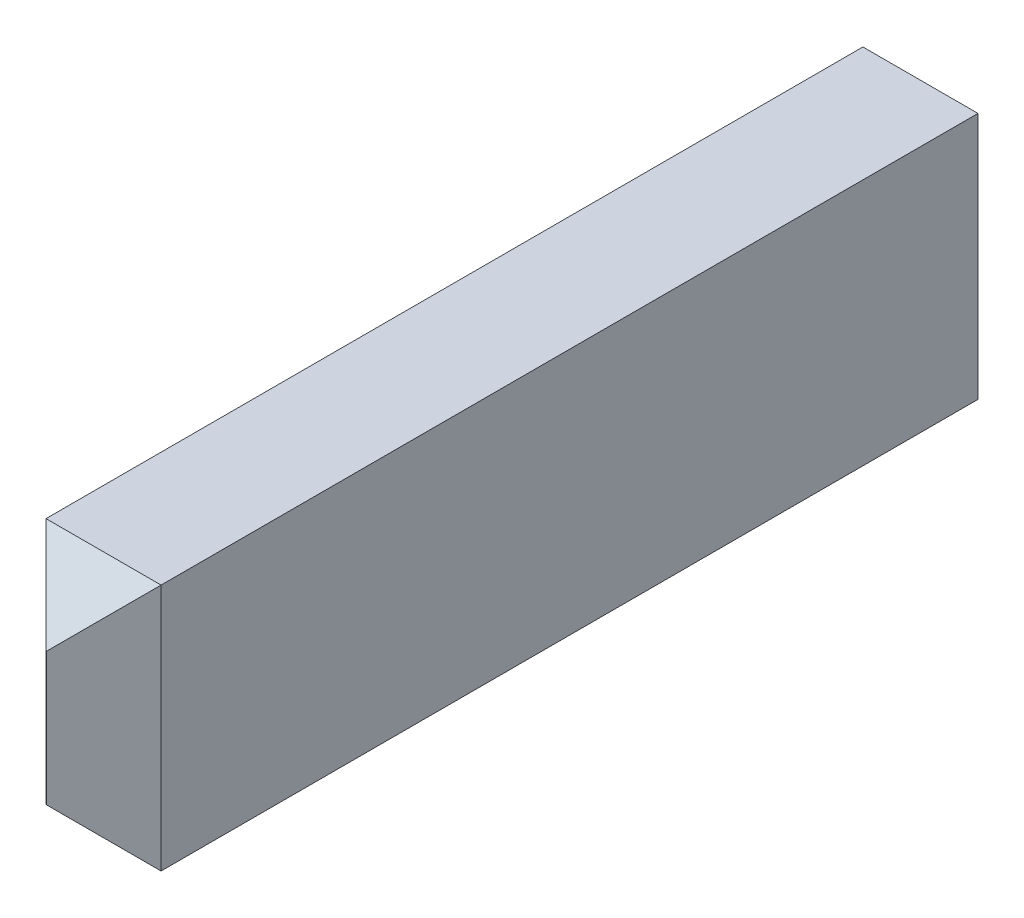
ISO-10303-21;
HEADER;
FILE_DESCRIPTION(('STEP AP214'),'2;1');
FILE_NAME('part.step','',(''),(''),'','','');
FILE_SCHEMA(('AUTOMOTIVE_DESIGN { 1 0 10303 214 1 1 1 1 }'));
ENDSEC;
DATA;
#1=APPLICATION_CONTEXT('core data for automotive mechanical design processes');
#2=APPLICATION_PROTOCOL_DEFINITION('international standard','automotive_design',2000,#1);
#3=PRODUCT_CONTEXT('',#1,'mechanical');
#4=PRODUCT('Part','Part','',(#3));
#5=PRODUCT_RELATED_PRODUCT_CATEGORY('part','',(#4));
#6=PRODUCT_DEFINITION_FORMATION('','',#4);
#7=PRODUCT_DEFINITION_CONTEXT('part definition',#1,'design');
#8=PRODUCT_DEFINITION('design','',#6,#7);
#9=PRODUCT_DEFINITION_SHAPE('','',#8);
#10=(LENGTH_UNIT() NAMED_UNIT(*) SI_UNIT(.MILLI.,.METRE.));
#11=(NAMED_UNIT(*) PLANE_ANGLE_UNIT() SI_UNIT($,.RADIAN.));
#12=(NAMED_UNIT(*) SI_UNIT($,.STERADIAN.) SOLID_ANGLE_UNIT());
#13=UNCERTAINTY_MEASURE_WITH_UNIT(LENGTH_MEASURE(1.E-05),#10,'distance_accuracy_value','');
#14=(GEOMETRIC_REPRESENTATION_CONTEXT(3) GLOBAL_UNCERTAINTY_ASSIGNED_CONTEXT((#13)) GLOBAL_UNIT_ASSIGNED_CONTEXT((#10,
#11,#12)) REPRESENTATION_CONTEXT('',''));
#15=CARTESIAN_POINT('',(0.,0.,0.));
#16=DIRECTION('',(0.,0.,1.));
#17=DIRECTION('',(1.,0.,0.));
#18=AXIS2_PLACEMENT_3D('',#15,#16,#17);
#19=CARTESIAN_POINT('',(0.504824999999816,-16.4732999999996,0.949324999998709));
#20=DIRECTION('',(0.707106781186547,0.,0.707106781186548));
#21=DIRECTION('',(0.707106781186548,0.,-0.707106781186547));
#22=AXIS2_PLACEMENT_3D('',#19,#20,#21);
#23=PLANE('',#22);
#24=DIRECTION('',(0.,1.,0.));
#25=VECTOR('',#24,1.);
#26=CARTESIAN_POINT('',(1.0033,-15.3938,0.450849999998724));
#27=LINE('',#26,#25);
#28=CARTESIAN_POINT('',(1.00329999999983,-15.3937999999997,0.450849999998722));
#29=VERTEX_POINT('',#28);
#30=CARTESIAN_POINT('',(1.00329999999985,-19.7117999999997,0.450849999998728));
#31=VERTEX_POINT('',#30);
#32=EDGE_CURVE('E94',#29,#31,#27,.F.);
#33=ORIENTED_EDGE('',*,*,#32,.F.);
#34=DIRECTION('',(0.577350269189635,0.577350269189622,-0.577350269189621));
#35=VECTOR('',#34,1.);
#36=CARTESIAN_POINT('',(0.00634999999981289,-16.3907499999996,1.4477999999987));
#37=LINE('',#36,#35);
#38=CARTESIAN_POINT('',(0.0063499999998155,-16.3907499999996,1.44779999999873));
#39=VERTEX_POINT('',#38);
#40=EDGE_CURVE('E83',#39,#29,#37,.T.);
#41=ORIENTED_EDGE('',*,*,#40,.F.);
#42=DIRECTION('',(0.,1.,0.));
#43=VECTOR('',#42,1.);
#44=CARTESIAN_POINT('',(0.00634999999981289,-17.5527999999996,1.44779999999876));
#45=LINE('',#44,#43);
#46=CARTESIAN_POINT('',(0.00634999999981552,-18.7148499999996,1.44779999999875));
#47=VERTEX_POINT('',#46);
#48=EDGE_CURVE('E67',#47,#39,#45,.T.);
#49=ORIENTED_EDGE('',*,*,#48,.F.);
#50=DIRECTION('',(-0.577350269189615,0.577350269189632,0.577350269189631));
#51=VECTOR('',#50,1.);
#52=CARTESIAN_POINT('',(1.0032999999998,-19.7117999999996,0.450849999998754));
#53=LINE('',#52,#51);
#54=EDGE_CURVE('E73',#31,#47,#53,.T.);
#55=ORIENTED_EDGE('',*,*,#54,.F.);
#56=EDGE_LOOP('',(#33,#41,#49,#55));
#57=FACE_BOUND('',#56,.T.);
#58=ADVANCED_FACE('F17',(#57),#23,.T.);
#59=CARTESIAN_POINT('',(0.501649999999803,-19.2133249999996,0.94932499999878));
#60=DIRECTION('',(0.,-0.707106781186547,0.707106781186548));
#61=DIRECTION('',(0.,-0.707106781186548,-0.707106781186547));
#62=AXIS2_PLACEMENT_3D('',#59,#60,#61);
#63=PLANE('',#62);
#64=DIRECTION('',(1.,0.,0.));
#65=VECTOR('',#64,1.);
#66=CARTESIAN_POINT('',(1.0033,-19.7118,0.450849999998724));
#67=LINE('',#66,#65);
#68=CARTESIAN_POINT('',(-1.00330000000017,-19.7117999999997,0.450849999998741));
#69=VERTEX_POINT('',#68);
#70=EDGE_CURVE('E78',#31,#69,#67,.F.);
#71=ORIENTED_EDGE('',*,*,#70,.F.);
#72=ORIENTED_EDGE('',*,*,#54,.T.);
#73=DIRECTION('',(1.,0.,0.));
#74=VECTOR('',#73,1.);
#75=CARTESIAN_POINT('',(-1.77635683940025E-13,-18.7148499999996,1.44779999999876));
#76=LINE('',#75,#74);
#77=CARTESIAN_POINT('',(-0.00635000000018649,-18.7148499999996,1.44779999999877));
#78=VERTEX_POINT('',#77);
#79=EDGE_CURVE('E75',#78,#47,#76,.T.);
#80=ORIENTED_EDGE('',*,*,#79,.F.);
#81=DIRECTION('',(-0.577350269189621,-0.577350269189629,-0.577350269189628));
#82=VECTOR('',#81,1.);
#83=CARTESIAN_POINT('',(-0.00635000000018596,-18.7148499999996,1.44779999999877));
#84=LINE('',#83,#82);
#85=EDGE_CURVE('E20',#78,#69,#84,.T.);
#86=ORIENTED_EDGE('',*,*,#85,.T.);
#87=EDGE_LOOP('',(#71,#72,#80,#86));
#88=FACE_BOUND('',#87,.T.);
#89=ADVANCED_FACE('F74',(#88),#63,.T.);
#90=CARTESIAN_POINT('',(-1.77635683940025E-13,-17.5527999999996,1.44779999999876));
#91=DIRECTION('',(0.,0.,1.));
#92=DIRECTION('',(1.,0.,0.));
#93=AXIS2_PLACEMENT_3D('',#90,#91,#92);
#94=PLANE('',#93);
#95=DIRECTION('',(1.,0.,0.));
#96=VECTOR('',#95,1.);
#97=CARTESIAN_POINT('',(-0.501650000000176,-16.3907499999996,1.4477999999987));
#98=LINE('',#97,#96);
#99=CARTESIAN_POINT('',(-0.00635000000018658,-16.3907499999996,1.44779999999875));
#100=VERTEX_POINT('',#99);
#101=EDGE_CURVE('E85',#100,#39,#98,.T.);
#102=ORIENTED_EDGE('',*,*,#101,.F.);
#103=DIRECTION('',(0.,1.,0.));
#104=VECTOR('',#103,1.);
#105=CARTESIAN_POINT('',(-0.00635000000018813,-18.6322999999996,1.44779999999876));
#106=LINE('',#105,#104);
#107=EDGE_CURVE('E89',#78,#100,#106,.T.);
#108=ORIENTED_EDGE('',*,*,#107,.F.);
#109=ORIENTED_EDGE('',*,*,#79,.T.);
#110=ORIENTED_EDGE('',*,*,#48,.T.);
#111=EDGE_LOOP('',(#102,#108,#109,#110));
#112=FACE_BOUND('',#111,.T.);
#113=ADVANCED_FACE('F87',(#112),#94,.T.);
#114=CARTESIAN_POINT('',(-0.501650000000176,-15.8922749999996,0.949324999998709));
#115=DIRECTION('',(0.,0.707106781186547,0.707106781186548));
#116=DIRECTION('',(0.,-0.707106781186548,0.707106781186547));
#117=AXIS2_PLACEMENT_3D('',#114,#115,#116);
#118=PLANE('',#117);
#119=DIRECTION('',(1.,0.,0.));
#120=VECTOR('',#119,1.);
#121=CARTESIAN_POINT('',(-1.0033,-15.3938,0.450849999998724));
#122=LINE('',#121,#120);
#123=CARTESIAN_POINT('',(-1.00330000000017,-15.3937999999997,0.450849999998725));
#124=VERTEX_POINT('',#123);
#125=EDGE_CURVE('E103',#124,#29,#122,.T.);
#126=ORIENTED_EDGE('',*,*,#125,.F.);
#127=DIRECTION('',(-0.577350269189623,0.577350269189632,-0.577350269189622));
#128=VECTOR('',#127,1.);
#129=CARTESIAN_POINT('',(-0.00635000000022332,-16.3907499999996,1.44779999999873));
#130=LINE('',#129,#128);
#131=EDGE_CURVE('E100',#100,#124,#130,.T.);
#132=ORIENTED_EDGE('',*,*,#131,.F.);
#133=ORIENTED_EDGE('',*,*,#101,.T.);
#134=ORIENTED_EDGE('',*,*,#40,.T.);
#135=EDGE_LOOP('',(#126,#132,#133,#134));
#136=FACE_BOUND('',#135,.T.);
#137=ADVANCED_FACE('F129',(#136),#118,.T.);
#138=CARTESIAN_POINT('',(1.0033,-15.3938,-13.7922));
#139=DIRECTION('',(1.,0.,0.));
#140=DIRECTION('',(0.,0.,-1.));
#141=AXIS2_PLACEMENT_3D('',#138,#139,#140);
#142=PLANE('',#141);
#143=DIRECTION('',(0.,0.,-1.));
#144=VECTOR('',#143,1.);
#145=CARTESIAN_POINT('',(1.00329999999982,-19.7118,-13.7922));
#146=LINE('',#145,#144);
#147=CARTESIAN_POINT('',(1.00329999999987,-19.7117999999998,-13.7922000000016));
#148=VERTEX_POINT('',#147);
#149=EDGE_CURVE('E96',#148,#31,#146,.F.);
#150=ORIENTED_EDGE('',*,*,#149,.F.);
#151=DIRECTION('',(0.,1.,0.));
#152=VECTOR('',#151,1.);
#153=CARTESIAN_POINT('',(1.00329999999982,0.431800000000866,-13.7922000000026));
#154=LINE('',#153,#152);
#155=CARTESIAN_POINT('',(1.00329999999987,-15.3937999999998,-13.7922000000016));
#156=VERTEX_POINT('',#155);
#157=EDGE_CURVE('E112',#148,#156,#154,.T.);
#158=ORIENTED_EDGE('',*,*,#157,.T.);
#159=DIRECTION('',(0.,0.,1.));
#160=VECTOR('',#159,1.);
#161=CARTESIAN_POINT('',(1.00329999999982,-15.3938,-13.7922));
#162=LINE('',#161,#160);
#163=EDGE_CURVE('E106',#29,#156,#162,.F.);
#164=ORIENTED_EDGE('',*,*,#163,.F.);
#165=ORIENTED_EDGE('',*,*,#32,.T.);
#166=EDGE_LOOP('',(#150,#158,#164,#165));
#167=FACE_BOUND('',#166,.T.);
#168=ADVANCED_FACE('F137',(#167),#142,.T.);
#169=CARTESIAN_POINT('',(1.0033,-19.7118,-13.7922));
#170=DIRECTION('',(0.,-1.,0.));
#171=DIRECTION('',(0.,0.,-1.));
#172=AXIS2_PLACEMENT_3D('',#169,#170,#171);
#173=PLANE('',#172);
#174=DIRECTION('',(0.,0.,1.));
#175=VECTOR('',#174,1.);
#176=CARTESIAN_POINT('',(-1.0033,-19.7117999999996,-13.7922));
#177=LINE('',#176,#175);
#178=CARTESIAN_POINT('',(-1.00330000000014,-19.7117999999998,-13.7922000000016));
#179=VERTEX_POINT('',#178);
#180=EDGE_CURVE('E115',#179,#69,#177,.T.);
#181=ORIENTED_EDGE('',*,*,#180,.F.);
#182=DIRECTION('',(1.,0.,0.));
#183=VECTOR('',#182,1.);
#184=CARTESIAN_POINT('',(-3.5527136788005E-13,-19.7117999999996,-13.7922000000026));
#185=LINE('',#184,#183);
#186=EDGE_CURVE('E109',#179,#148,#185,.T.);
#187=ORIENTED_EDGE('',*,*,#186,.T.);
#188=ORIENTED_EDGE('',*,*,#149,.T.);
#189=ORIENTED_EDGE('',*,*,#70,.T.);
#190=EDGE_LOOP('',(#181,#187,#188,#189));
#191=FACE_BOUND('',#190,.T.);
#192=ADVANCED_FACE('F133',(#191),#173,.T.);
#193=CARTESIAN_POINT('',(-0.504825000000171,-18.6322999999996,0.94932499999878));
#194=DIRECTION('',(-0.707106781186547,0.,0.707106781186548));
#195=DIRECTION('',(0.707106781186548,0.,0.707106781186547));
#196=AXIS2_PLACEMENT_3D('',#193,#194,#195);
#197=PLANE('',#196);
#198=DIRECTION('',(0.,1.,0.));
#199=VECTOR('',#198,1.);
#200=CARTESIAN_POINT('',(-1.0033,-19.7118,0.450849999998724));
#201=LINE('',#200,#199);
#202=EDGE_CURVE('E118',#69,#124,#201,.T.);
#203=ORIENTED_EDGE('',*,*,#202,.F.);
#204=ORIENTED_EDGE('',*,*,#85,.F.);
#205=ORIENTED_EDGE('',*,*,#107,.T.);
#206=ORIENTED_EDGE('',*,*,#131,.T.);
#207=EDGE_LOOP('',(#203,#204,#205,#206));
#208=FACE_BOUND('',#207,.T.);
#209=ADVANCED_FACE('F131',(#208),#197,.T.);
#210=CARTESIAN_POINT('',(-1.0033,-15.3938,-13.7922));
#211=DIRECTION('',(0.,1.,0.));
#212=DIRECTION('',(0.,0.,1.));
#213=AXIS2_PLACEMENT_3D('',#210,#211,#212);
#214=PLANE('',#213);
#215=ORIENTED_EDGE('',*,*,#163,.T.);
#216=DIRECTION('',(1.,0.,0.));
#217=VECTOR('',#216,1.);
#218=CARTESIAN_POINT('',(-3.5527136788005E-13,-15.3937999999996,-13.7922000000026));
#219=LINE('',#218,#217);
#220=CARTESIAN_POINT('',(-1.00330000000014,-15.3937999999998,-13.7922000000016));
#221=VERTEX_POINT('',#220);
#222=EDGE_CURVE('E35',#156,#221,#219,.F.);
#223=ORIENTED_EDGE('',*,*,#222,.T.);
#224=DIRECTION('',(0.,0.,1.));
#225=VECTOR('',#224,1.);
#226=CARTESIAN_POINT('',(-1.0033,-15.3937999999996,-13.7922));
#227=LINE('',#226,#225);
#228=EDGE_CURVE('E26',#124,#221,#227,.F.);
#229=ORIENTED_EDGE('',*,*,#228,.F.);
#230=ORIENTED_EDGE('',*,*,#125,.T.);
#231=EDGE_LOOP('',(#215,#223,#229,#230));
#232=FACE_BOUND('',#231,.T.);
#233=ADVANCED_FACE('F125',(#232),#214,.T.);
#234=CARTESIAN_POINT('',(-3.5527136788005E-13,0.431800000000866,-13.7922000000026));
#235=DIRECTION('',(0.,0.,1.));
#236=DIRECTION('',(1.,0.,0.));
#237=AXIS2_PLACEMENT_3D('',#234,#235,#236);
#238=PLANE('',#237);
#239=ORIENTED_EDGE('',*,*,#186,.F.);
#240=DIRECTION('',(0.,1.,0.));
#241=VECTOR('',#240,1.);
#242=CARTESIAN_POINT('',(-1.0033,-19.7118,-13.7922000000013));
#243=LINE('',#242,#241);
#244=EDGE_CURVE('E11',#221,#179,#243,.F.);
#245=ORIENTED_EDGE('',*,*,#244,.F.);
#246=ORIENTED_EDGE('',*,*,#222,.F.);
#247=ORIENTED_EDGE('',*,*,#157,.F.);
#248=EDGE_LOOP('',(#239,#245,#246,#247));
#249=FACE_BOUND('',#248,.T.);
#250=ADVANCED_FACE('F139',(#249),#238,.F.);
#251=CARTESIAN_POINT('',(-1.0033,-19.7118,-13.7922));
#252=DIRECTION('',(-1.,0.,0.));
#253=DIRECTION('',(0.,0.,1.));
#254=AXIS2_PLACEMENT_3D('',#251,#252,#253);
#255=PLANE('',#254);
#256=ORIENTED_EDGE('',*,*,#228,.T.);
#257=ORIENTED_EDGE('',*,*,#244,.T.);
#258=ORIENTED_EDGE('',*,*,#180,.T.);
#259=ORIENTED_EDGE('',*,*,#202,.T.);
#260=EDGE_LOOP('',(#256,#257,#258,#259));
#261=FACE_BOUND('',#260,.T.);
#262=ADVANCED_FACE('F123',(#261),#255,.T.);
#263=CLOSED_SHELL('',(#58,#89,#113,#137,#168,#192,#209,#233,#250,#262));
#264=MANIFOLD_SOLID_BREP('B1',#263);
#265=ADVANCED_BREP_SHAPE_REPRESENTATION('',(#18,#264),#14);
#266=SHAPE_DEFINITION_REPRESENTATION(#9,#265);
ENDSEC;
END-ISO-10303-21;
